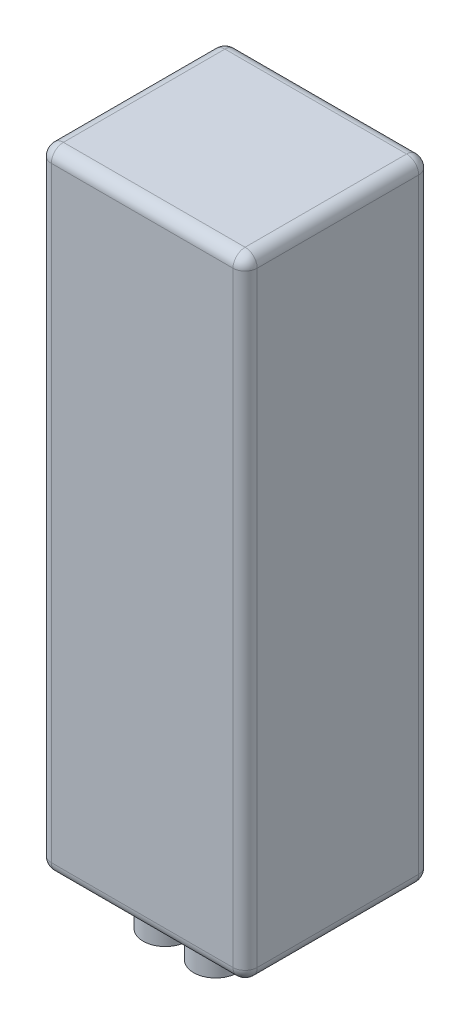
ISO-10303-21;
HEADER;
FILE_DESCRIPTION(('STEP AP214'),'2;1');
FILE_NAME('part.step','',(''),(''),'','','');
FILE_SCHEMA(('AUTOMOTIVE_DESIGN { 1 0 10303 214 1 1 1 1 }'));
ENDSEC;
DATA;
#1=APPLICATION_CONTEXT('core data for automotive mechanical design processes');
#2=APPLICATION_PROTOCOL_DEFINITION('international standard','automotive_design',2000,#1);
#3=PRODUCT_CONTEXT('',#1,'mechanical');
#4=PRODUCT('Part','Part','',(#3));
#5=PRODUCT_RELATED_PRODUCT_CATEGORY('part','',(#4));
#6=PRODUCT_DEFINITION_FORMATION('','',#4);
#7=PRODUCT_DEFINITION_CONTEXT('part definition',#1,'design');
#8=PRODUCT_DEFINITION('design','',#6,#7);
#9=PRODUCT_DEFINITION_SHAPE('','',#8);
#10=(LENGTH_UNIT() NAMED_UNIT(*) SI_UNIT(.MILLI.,.METRE.));
#11=(NAMED_UNIT(*) PLANE_ANGLE_UNIT() SI_UNIT($,.RADIAN.));
#12=(NAMED_UNIT(*) SI_UNIT($,.STERADIAN.) SOLID_ANGLE_UNIT());
#13=UNCERTAINTY_MEASURE_WITH_UNIT(LENGTH_MEASURE(1.E-05),#10,'distance_accuracy_value','');
#14=(GEOMETRIC_REPRESENTATION_CONTEXT(3) GLOBAL_UNCERTAINTY_ASSIGNED_CONTEXT((#13)) GLOBAL_UNIT_ASSIGNED_CONTEXT((#10,
#11,#12)) REPRESENTATION_CONTEXT('',''));
#15=CARTESIAN_POINT('',(0.,0.,0.));
#16=DIRECTION('',(0.,0.,1.));
#17=DIRECTION('',(1.,0.,0.));
#18=AXIS2_PLACEMENT_3D('',#15,#16,#17);
#19=CARTESIAN_POINT('',(-39.4955547458553,156.,-20.7));
#20=DIRECTION('',(1.,0.,0.));
#21=DIRECTION('',(0.,0.,-1.));
#22=AXIS2_PLACEMENT_3D('',#19,#20,#21);
#23=PLANE('',#22);
#24=DIRECTION('',(0.,0.,1.));
#25=VECTOR('',#24,1.);
#26=CARTESIAN_POINT('',(-39.4955547458553,153.,-20.7));
#27=LINE('',#26,#25);
#28=CARTESIAN_POINT('',(-39.4955547458553,153.,22.3));
#29=VERTEX_POINT('',#28);
#30=CARTESIAN_POINT('',(-39.4955547458553,153.,-17.7));
#31=VERTEX_POINT('',#30);
#32=EDGE_CURVE('E198',#29,#31,#27,.F.);
#33=ORIENTED_EDGE('',*,*,#32,.T.);
#34=DIRECTION('',(0.,-1.,0.));
#35=VECTOR('',#34,1.);
#36=CARTESIAN_POINT('',(-39.4955547458553,156.,-17.7));
#37=LINE('',#36,#35);
#38=CARTESIAN_POINT('',(-39.4955547458553,3.,-17.7));
#39=VERTEX_POINT('',#38);
#40=EDGE_CURVE('E201',#31,#39,#37,.T.);
#41=ORIENTED_EDGE('',*,*,#40,.T.);
#42=DIRECTION('',(0.,0.,1.));
#43=VECTOR('',#42,1.);
#44=CARTESIAN_POINT('',(-39.4955547458553,3.,-20.7));
#45=LINE('',#44,#43);
#46=CARTESIAN_POINT('',(-39.4955547458553,3.,22.3));
#47=VERTEX_POINT('',#46);
#48=EDGE_CURVE('E196',#39,#47,#45,.T.);
#49=ORIENTED_EDGE('',*,*,#48,.T.);
#50=DIRECTION('',(0.,-1.,0.));
#51=VECTOR('',#50,1.);
#52=CARTESIAN_POINT('',(-39.4955547458553,156.,22.3));
#53=LINE('',#52,#51);
#54=EDGE_CURVE('E194',#47,#29,#53,.F.);
#55=ORIENTED_EDGE('',*,*,#54,.T.);
#56=EDGE_LOOP('',(#33,#41,#49,#55));
#57=FACE_BOUND('',#56,.T.);
#58=ADVANCED_FACE('F42',(#57),#23,.F.);
#59=CARTESIAN_POINT('',(-39.4955547458553,156.,25.3));
#60=DIRECTION('',(0.,0.,-1.));
#61=DIRECTION('',(-1.,0.,0.));
#62=AXIS2_PLACEMENT_3D('',#59,#60,#61);
#63=PLANE('',#62);
#64=DIRECTION('',(1.,0.,0.));
#65=VECTOR('',#64,1.);
#66=CARTESIAN_POINT('',(-39.4955547458553,153.,25.3));
#67=LINE('',#66,#65);
#68=CARTESIAN_POINT('',(8.50444525414467,153.,25.3));
#69=VERTEX_POINT('',#68);
#70=CARTESIAN_POINT('',(-36.4955547458553,153.,25.3));
#71=VERTEX_POINT('',#70);
#72=EDGE_CURVE('E57',#69,#71,#67,.F.);
#73=ORIENTED_EDGE('',*,*,#72,.T.);
#74=DIRECTION('',(0.,-1.,0.));
#75=VECTOR('',#74,1.);
#76=CARTESIAN_POINT('',(-36.4955547458553,156.,25.3));
#77=LINE('',#76,#75);
#78=CARTESIAN_POINT('',(-36.4955547458553,3.,25.3));
#79=VERTEX_POINT('',#78);
#80=EDGE_CURVE('E216',#71,#79,#77,.T.);
#81=ORIENTED_EDGE('',*,*,#80,.T.);
#82=DIRECTION('',(1.,0.,0.));
#83=VECTOR('',#82,1.);
#84=CARTESIAN_POINT('',(-39.4955547458553,3.,25.3));
#85=LINE('',#84,#83);
#86=CARTESIAN_POINT('',(8.50444525414467,3.,25.3));
#87=VERTEX_POINT('',#86);
#88=EDGE_CURVE('E212',#79,#87,#85,.T.);
#89=ORIENTED_EDGE('',*,*,#88,.T.);
#90=DIRECTION('',(0.,-1.,0.));
#91=VECTOR('',#90,1.);
#92=CARTESIAN_POINT('',(8.50444525414467,156.,25.3));
#93=LINE('',#92,#91);
#94=EDGE_CURVE('E62',#87,#69,#93,.F.);
#95=ORIENTED_EDGE('',*,*,#94,.T.);
#96=EDGE_LOOP('',(#73,#81,#89,#95));
#97=FACE_BOUND('',#96,.T.);
#98=ADVANCED_FACE('F328',(#97),#63,.F.);
#99=CARTESIAN_POINT('',(11.5044452541447,156.,-20.7));
#100=DIRECTION('',(-1.,0.,0.));
#101=DIRECTION('',(0.,0.,1.));
#102=AXIS2_PLACEMENT_3D('',#99,#100,#101);
#103=PLANE('',#102);
#104=DIRECTION('',(0.,0.,-1.));
#105=VECTOR('',#104,1.);
#106=CARTESIAN_POINT('',(11.5044452541447,3.,-20.7));
#107=LINE('',#106,#105);
#108=CARTESIAN_POINT('',(11.5044452541447,3.,22.3));
#109=VERTEX_POINT('',#108);
#110=CARTESIAN_POINT('',(11.5044452541447,3.,-17.7));
#111=VERTEX_POINT('',#110);
#112=EDGE_CURVE('E141',#109,#111,#107,.T.);
#113=ORIENTED_EDGE('',*,*,#112,.T.);
#114=DIRECTION('',(0.,-1.,0.));
#115=VECTOR('',#114,1.);
#116=CARTESIAN_POINT('',(11.5044452541447,156.,-17.7));
#117=LINE('',#116,#115);
#118=CARTESIAN_POINT('',(11.5044452541447,153.,-17.7));
#119=VERTEX_POINT('',#118);
#120=EDGE_CURVE('E137',#111,#119,#117,.F.);
#121=ORIENTED_EDGE('',*,*,#120,.T.);
#122=DIRECTION('',(0.,0.,-1.));
#123=VECTOR('',#122,1.);
#124=CARTESIAN_POINT('',(11.5044452541447,153.,25.3));
#125=LINE('',#124,#123);
#126=CARTESIAN_POINT('',(11.5044452541447,153.,22.3));
#127=VERTEX_POINT('',#126);
#128=EDGE_CURVE('E129',#119,#127,#125,.F.);
#129=ORIENTED_EDGE('',*,*,#128,.T.);
#130=DIRECTION('',(0.,-1.,0.));
#131=VECTOR('',#130,1.);
#132=CARTESIAN_POINT('',(11.5044452541447,156.,22.3));
#133=LINE('',#132,#131);
#134=EDGE_CURVE('E134',#127,#109,#133,.T.);
#135=ORIENTED_EDGE('',*,*,#134,.T.);
#136=EDGE_LOOP('',(#113,#121,#129,#135));
#137=FACE_BOUND('',#136,.T.);
#138=ADVANCED_FACE('F132',(#137),#103,.F.);
#139=CARTESIAN_POINT('',(-39.4955547458553,156.,-20.7));
#140=DIRECTION('',(0.,0.,1.));
#141=DIRECTION('',(1.,0.,0.));
#142=AXIS2_PLACEMENT_3D('',#139,#140,#141);
#143=PLANE('',#142);
#144=DIRECTION('',(-1.,0.,0.));
#145=VECTOR('',#144,1.);
#146=CARTESIAN_POINT('',(11.5044452541447,153.,-20.7));
#147=LINE('',#146,#145);
#148=CARTESIAN_POINT('',(-36.4955547458553,153.,-20.7));
#149=VERTEX_POINT('',#148);
#150=CARTESIAN_POINT('',(8.50444525414466,153.,-20.7));
#151=VERTEX_POINT('',#150);
#152=EDGE_CURVE('E207',#149,#151,#147,.F.);
#153=ORIENTED_EDGE('',*,*,#152,.T.);
#154=DIRECTION('',(0.,-1.,0.));
#155=VECTOR('',#154,1.);
#156=CARTESIAN_POINT('',(8.50444525414466,156.,-20.7));
#157=LINE('',#156,#155);
#158=CARTESIAN_POINT('',(8.50444525414466,3.,-20.7));
#159=VERTEX_POINT('',#158);
#160=EDGE_CURVE('E209',#151,#159,#157,.T.);
#161=ORIENTED_EDGE('',*,*,#160,.T.);
#162=DIRECTION('',(-1.,0.,0.));
#163=VECTOR('',#162,1.);
#164=CARTESIAN_POINT('',(-39.4955547458553,3.,-20.7));
#165=LINE('',#164,#163);
#166=CARTESIAN_POINT('',(-36.4955547458553,3.,-20.7));
#167=VERTEX_POINT('',#166);
#168=EDGE_CURVE('E203',#159,#167,#165,.T.);
#169=ORIENTED_EDGE('',*,*,#168,.T.);
#170=DIRECTION('',(0.,-1.,0.));
#171=VECTOR('',#170,1.);
#172=CARTESIAN_POINT('',(-36.4955547458553,156.,-20.7));
#173=LINE('',#172,#171);
#174=EDGE_CURVE('E205',#167,#149,#173,.F.);
#175=ORIENTED_EDGE('',*,*,#174,.T.);
#176=EDGE_LOOP('',(#153,#161,#169,#175));
#177=FACE_BOUND('',#176,.T.);
#178=ADVANCED_FACE('F369',(#177),#143,.F.);
#179=CARTESIAN_POINT('',(0.,156.,0.));
#180=DIRECTION('',(0.,1.,0.));
#181=DIRECTION('',(0.,0.,1.));
#182=AXIS2_PLACEMENT_3D('',#179,#180,#181);
#183=PLANE('',#182);
#184=DIRECTION('',(0.,0.,-1.));
#185=VECTOR('',#184,1.);
#186=CARTESIAN_POINT('',(8.50444525414466,156.,-20.7));
#187=LINE('',#186,#185);
#188=CARTESIAN_POINT('',(8.50444525414467,156.,22.3));
#189=VERTEX_POINT('',#188);
#190=CARTESIAN_POINT('',(8.50444525414466,156.,-17.7));
#191=VERTEX_POINT('',#190);
#192=EDGE_CURVE('E149',#189,#191,#187,.T.);
#193=ORIENTED_EDGE('',*,*,#192,.T.);
#194=DIRECTION('',(-1.,0.,0.));
#195=VECTOR('',#194,1.);
#196=CARTESIAN_POINT('',(-39.4955547458553,156.,-17.7));
#197=LINE('',#196,#195);
#198=CARTESIAN_POINT('',(-36.4955547458553,156.,-17.7));
#199=VERTEX_POINT('',#198);
#200=EDGE_CURVE('E192',#191,#199,#197,.T.);
#201=ORIENTED_EDGE('',*,*,#200,.T.);
#202=DIRECTION('',(0.,0.,1.));
#203=VECTOR('',#202,1.);
#204=CARTESIAN_POINT('',(-36.4955547458553,156.,25.3));
#205=LINE('',#204,#203);
#206=CARTESIAN_POINT('',(-36.4955547458553,156.,22.3));
#207=VERTEX_POINT('',#206);
#208=EDGE_CURVE('E189',#199,#207,#205,.T.);
#209=ORIENTED_EDGE('',*,*,#208,.T.);
#210=DIRECTION('',(1.,0.,0.));
#211=VECTOR('',#210,1.);
#212=CARTESIAN_POINT('',(11.5044452541447,156.,22.3));
#213=LINE('',#212,#211);
#214=EDGE_CURVE('E187',#207,#189,#213,.T.);
#215=ORIENTED_EDGE('',*,*,#214,.T.);
#216=EDGE_LOOP('',(#193,#201,#209,#215));
#217=FACE_BOUND('',#216,.T.);
#218=ADVANCED_FACE('F274',(#217),#183,.T.);
#219=CARTESIAN_POINT('',(0.,0.,0.));
#220=DIRECTION('',(0.,1.,0.));
#221=DIRECTION('',(0.,0.,1.));
#222=AXIS2_PLACEMENT_3D('',#219,#220,#221);
#223=PLANE('',#222);
#224=CARTESIAN_POINT('',(-8.24897588452238,0.,12.8249841101593));
#225=DIRECTION('',(0.,1.,0.));
#226=DIRECTION('',(0.,0.,1.));
#227=AXIS2_PLACEMENT_3D('',#224,#225,#226);
#228=CIRCLE('',#227,5.4796658138375);
#229=CARTESIAN_POINT('',(-8.24897588452238,0.,18.3046499239968));
#230=VERTEX_POINT('',#229);
#231=EDGE_CURVE('E11',#230,#230,#228,.F.);
#232=ORIENTED_EDGE('',*,*,#231,.F.);
#233=EDGE_LOOP('',(#232));
#234=FACE_BOUND('',#233,.T.);
#235=CARTESIAN_POINT('',(-21.2412411362317,0.,12.3252816004782));
#236=DIRECTION('',(0.,1.,0.));
#237=DIRECTION('',(0.,0.,1.));
#238=AXIS2_PLACEMENT_3D('',#235,#236,#237);
#239=CIRCLE('',#238,5.4796658138375);
#240=CARTESIAN_POINT('',(-21.2412411362317,0.,17.8049474143157));
#241=VERTEX_POINT('',#240);
#242=EDGE_CURVE('E50',#241,#241,#239,.F.);
#243=ORIENTED_EDGE('',*,*,#242,.F.);
#244=EDGE_LOOP('',(#243));
#245=FACE_BOUND('',#244,.T.);
#246=DIRECTION('',(0.,0.,1.));
#247=VECTOR('',#246,1.);
#248=CARTESIAN_POINT('',(-36.4955547458553,0.,0.));
#249=LINE('',#248,#247);
#250=CARTESIAN_POINT('',(-36.4955547458553,0.,22.3));
#251=VERTEX_POINT('',#250);
#252=CARTESIAN_POINT('',(-36.4955547458553,0.,-17.7));
#253=VERTEX_POINT('',#252);
#254=EDGE_CURVE('E180',#251,#253,#249,.F.);
#255=ORIENTED_EDGE('',*,*,#254,.T.);
#256=DIRECTION('',(-1.,0.,0.));
#257=VECTOR('',#256,1.);
#258=CARTESIAN_POINT('',(0.,0.,-17.7));
#259=LINE('',#258,#257);
#260=CARTESIAN_POINT('',(8.50444525414466,0.,-17.7));
#261=VERTEX_POINT('',#260);
#262=EDGE_CURVE('E185',#253,#261,#259,.F.);
#263=ORIENTED_EDGE('',*,*,#262,.T.);
#264=DIRECTION('',(0.,0.,-1.));
#265=VECTOR('',#264,1.);
#266=CARTESIAN_POINT('',(8.50444525414467,0.,0.));
#267=LINE('',#266,#265);
#268=CARTESIAN_POINT('',(8.50444525414467,0.,22.3));
#269=VERTEX_POINT('',#268);
#270=EDGE_CURVE('E182',#261,#269,#267,.F.);
#271=ORIENTED_EDGE('',*,*,#270,.T.);
#272=DIRECTION('',(1.,0.,0.));
#273=VECTOR('',#272,1.);
#274=CARTESIAN_POINT('',(0.,0.,22.3));
#275=LINE('',#274,#273);
#276=EDGE_CURVE('E178',#269,#251,#275,.F.);
#277=ORIENTED_EDGE('',*,*,#276,.T.);
#278=EDGE_LOOP('',(#255,#263,#271,#277));
#279=FACE_BOUND('',#278,.T.);
#280=ADVANCED_FACE('F271',(#234,#245,#279),#223,.F.);
#281=CARTESIAN_POINT('',(-36.4955547458553,153.,0.));
#282=DIRECTION('',(0.,0.,-1.));
#283=DIRECTION('',(-1.,0.,0.));
#284=AXIS2_PLACEMENT_3D('',#281,#282,#283);
#285=CYLINDRICAL_SURFACE('',#284,3.);
#286=CARTESIAN_POINT('',(-36.4955547458553,153.,22.3));
#287=DIRECTION('',(0.,0.,1.));
#288=DIRECTION('',(1.,0.,0.));
#289=AXIS2_PLACEMENT_3D('',#286,#287,#288);
#290=CIRCLE('',#289,3.);
#291=EDGE_CURVE('E167',#207,#29,#290,.T.);
#292=ORIENTED_EDGE('',*,*,#291,.F.);
#293=ORIENTED_EDGE('',*,*,#208,.F.);
#294=CARTESIAN_POINT('',(-36.4955547458553,153.,-17.7));
#295=DIRECTION('',(0.,0.,-1.));
#296=DIRECTION('',(-1.,0.,0.));
#297=AXIS2_PLACEMENT_3D('',#294,#295,#296);
#298=CIRCLE('',#297,3.);
#299=EDGE_CURVE('E170',#31,#199,#298,.T.);
#300=ORIENTED_EDGE('',*,*,#299,.F.);
#301=ORIENTED_EDGE('',*,*,#32,.F.);
#302=EDGE_LOOP('',(#292,#293,#300,#301));
#303=FACE_BOUND('',#302,.T.);
#304=ADVANCED_FACE('F44',(#303),#285,.T.);
#305=CARTESIAN_POINT('',(-36.4955547458553,153.,22.3));
#306=DIRECTION('',(-1.,0.,0.));
#307=DIRECTION('',(0.,0.,1.));
#308=AXIS2_PLACEMENT_3D('',#305,#306,#307);
#309=SPHERICAL_SURFACE('',#308,3.);
#310=CARTESIAN_POINT('',(-36.4955547458553,153.,22.3));
#311=DIRECTION('',(-1.,0.,0.));
#312=DIRECTION('',(0.,0.,1.));
#313=AXIS2_PLACEMENT_3D('',#310,#311,#312);
#314=CIRCLE('',#313,3.);
#315=EDGE_CURVE('E260',#207,#71,#314,.F.);
#316=ORIENTED_EDGE('',*,*,#315,.F.);
#317=ORIENTED_EDGE('',*,*,#291,.T.);
#318=CARTESIAN_POINT('',(-36.4955547458553,153.,22.3));
#319=DIRECTION('',(0.,1.,0.));
#320=DIRECTION('',(0.,0.,1.));
#321=AXIS2_PLACEMENT_3D('',#318,#319,#320);
#322=CIRCLE('',#321,3.);
#323=EDGE_CURVE('E262',#71,#29,#322,.F.);
#324=ORIENTED_EDGE('',*,*,#323,.F.);
#325=EDGE_LOOP('',(#316,#317,#324));
#326=FACE_BOUND('',#325,.T.);
#327=ADVANCED_FACE('F323',(#326),#309,.T.);
#328=CARTESIAN_POINT('',(-36.4955547458553,153.,-17.7));
#329=DIRECTION('',(0.,1.,0.));
#330=DIRECTION('',(0.,0.,1.));
#331=AXIS2_PLACEMENT_3D('',#328,#329,#330);
#332=SPHERICAL_SURFACE('',#331,3.);
#333=CARTESIAN_POINT('',(-36.4955547458553,153.,-17.7));
#334=DIRECTION('',(0.,1.,0.));
#335=DIRECTION('',(0.,0.,1.));
#336=AXIS2_PLACEMENT_3D('',#333,#334,#335);
#337=CIRCLE('',#336,3.);
#338=EDGE_CURVE('E254',#31,#149,#337,.F.);
#339=ORIENTED_EDGE('',*,*,#338,.F.);
#340=ORIENTED_EDGE('',*,*,#299,.T.);
#341=CARTESIAN_POINT('',(-36.4955547458553,153.,-17.7));
#342=DIRECTION('',(-1.,0.,0.));
#343=DIRECTION('',(0.,0.,1.));
#344=AXIS2_PLACEMENT_3D('',#341,#342,#343);
#345=CIRCLE('',#344,3.);
#346=EDGE_CURVE('E257',#149,#199,#345,.F.);
#347=ORIENTED_EDGE('',*,*,#346,.F.);
#348=EDGE_LOOP('',(#339,#340,#347));
#349=FACE_BOUND('',#348,.T.);
#350=ADVANCED_FACE('F403',(#349),#332,.T.);
#351=CARTESIAN_POINT('',(-36.4955547458553,156.,22.3));
#352=DIRECTION('',(0.,-1.,0.));
#353=DIRECTION('',(0.,0.,-1.));
#354=AXIS2_PLACEMENT_3D('',#351,#352,#353);
#355=CYLINDRICAL_SURFACE('',#354,3.);
#356=ORIENTED_EDGE('',*,*,#323,.T.);
#357=ORIENTED_EDGE('',*,*,#54,.F.);
#358=CARTESIAN_POINT('',(-36.4955547458553,3.,22.3));
#359=DIRECTION('',(0.,-1.,0.));
#360=DIRECTION('',(0.,0.,-1.));
#361=AXIS2_PLACEMENT_3D('',#358,#359,#360);
#362=CIRCLE('',#361,3.);
#363=EDGE_CURVE('E248',#79,#47,#362,.T.);
#364=ORIENTED_EDGE('',*,*,#363,.F.);
#365=ORIENTED_EDGE('',*,*,#80,.F.);
#366=EDGE_LOOP('',(#356,#357,#364,#365));
#367=FACE_BOUND('',#366,.T.);
#368=ADVANCED_FACE('F327',(#367),#355,.T.);
#369=CARTESIAN_POINT('',(0.,153.,22.3));
#370=DIRECTION('',(-1.,0.,0.));
#371=DIRECTION('',(0.,0.,1.));
#372=AXIS2_PLACEMENT_3D('',#369,#370,#371);
#373=CYLINDRICAL_SURFACE('',#372,3.);
#374=ORIENTED_EDGE('',*,*,#315,.T.);
#375=ORIENTED_EDGE('',*,*,#72,.F.);
#376=CARTESIAN_POINT('',(8.50444525414467,153.,22.3));
#377=DIRECTION('',(1.,0.,0.));
#378=DIRECTION('',(0.,0.,-1.));
#379=AXIS2_PLACEMENT_3D('',#376,#377,#378);
#380=CIRCLE('',#379,3.);
#381=EDGE_CURVE('E153',#189,#69,#380,.T.);
#382=ORIENTED_EDGE('',*,*,#381,.F.);
#383=ORIENTED_EDGE('',*,*,#214,.F.);
#384=EDGE_LOOP('',(#374,#375,#382,#383));
#385=FACE_BOUND('',#384,.T.);
#386=ADVANCED_FACE('F318',(#385),#373,.T.);
#387=CARTESIAN_POINT('',(8.50444525414467,153.,0.));
#388=DIRECTION('',(0.,0.,1.));
#389=DIRECTION('',(1.,0.,0.));
#390=AXIS2_PLACEMENT_3D('',#387,#388,#389);
#391=CYLINDRICAL_SURFACE('',#390,3.);
#392=CARTESIAN_POINT('',(8.50444525414466,153.,-17.7));
#393=DIRECTION('',(0.,0.,-1.));
#394=DIRECTION('',(-1.,0.,0.));
#395=AXIS2_PLACEMENT_3D('',#392,#393,#394);
#396=CIRCLE('',#395,3.);
#397=EDGE_CURVE('E154',#191,#119,#396,.T.);
#398=ORIENTED_EDGE('',*,*,#397,.F.);
#399=ORIENTED_EDGE('',*,*,#192,.F.);
#400=CARTESIAN_POINT('',(8.50444525414467,153.,22.3));
#401=DIRECTION('',(0.,0.,1.));
#402=DIRECTION('',(0.,-1.,0.));
#403=AXIS2_PLACEMENT_3D('',#400,#401,#402);
#404=CIRCLE('',#403,3.);
#405=EDGE_CURVE('E145',#127,#189,#404,.T.);
#406=ORIENTED_EDGE('',*,*,#405,.F.);
#407=ORIENTED_EDGE('',*,*,#128,.F.);
#408=EDGE_LOOP('',(#398,#399,#406,#407));
#409=FACE_BOUND('',#408,.T.);
#410=ADVANCED_FACE('F147',(#409),#391,.T.);
#411=CARTESIAN_POINT('',(0.,153.,-17.7));
#412=DIRECTION('',(1.,0.,0.));
#413=DIRECTION('',(0.,0.,-1.));
#414=AXIS2_PLACEMENT_3D('',#411,#412,#413);
#415=CYLINDRICAL_SURFACE('',#414,3.);
#416=ORIENTED_EDGE('',*,*,#346,.T.);
#417=ORIENTED_EDGE('',*,*,#200,.F.);
#418=CARTESIAN_POINT('',(8.50444525414466,153.,-17.7));
#419=DIRECTION('',(1.,0.,0.));
#420=DIRECTION('',(0.,1.,0.));
#421=AXIS2_PLACEMENT_3D('',#418,#419,#420);
#422=CIRCLE('',#421,3.);
#423=EDGE_CURVE('E244',#151,#191,#422,.T.);
#424=ORIENTED_EDGE('',*,*,#423,.F.);
#425=ORIENTED_EDGE('',*,*,#152,.F.);
#426=EDGE_LOOP('',(#416,#417,#424,#425));
#427=FACE_BOUND('',#426,.T.);
#428=ADVANCED_FACE('F310',(#427),#415,.T.);
#429=CARTESIAN_POINT('',(-36.4955547458553,156.,-17.7));
#430=DIRECTION('',(0.,-1.,0.));
#431=DIRECTION('',(0.,0.,-1.));
#432=AXIS2_PLACEMENT_3D('',#429,#430,#431);
#433=CYLINDRICAL_SURFACE('',#432,3.);
#434=ORIENTED_EDGE('',*,*,#338,.T.);
#435=ORIENTED_EDGE('',*,*,#174,.F.);
#436=CARTESIAN_POINT('',(-36.4955547458553,3.,-17.7));
#437=DIRECTION('',(0.,-1.,0.));
#438=DIRECTION('',(0.,0.,-1.));
#439=AXIS2_PLACEMENT_3D('',#436,#437,#438);
#440=CIRCLE('',#439,3.);
#441=EDGE_CURVE('E241',#39,#167,#440,.T.);
#442=ORIENTED_EDGE('',*,*,#441,.F.);
#443=ORIENTED_EDGE('',*,*,#40,.F.);
#444=EDGE_LOOP('',(#434,#435,#442,#443));
#445=FACE_BOUND('',#444,.T.);
#446=ADVANCED_FACE('F439',(#445),#433,.T.);
#447=CARTESIAN_POINT('',(-36.4955547458553,3.,-20.7));
#448=DIRECTION('',(0.,0.,1.));
#449=DIRECTION('',(1.,0.,0.));
#450=AXIS2_PLACEMENT_3D('',#447,#448,#449);
#451=CYLINDRICAL_SURFACE('',#450,3.);
#452=CARTESIAN_POINT('',(-36.4955547458553,3.,22.3));
#453=DIRECTION('',(0.,0.,1.));
#454=DIRECTION('',(1.,0.,0.));
#455=AXIS2_PLACEMENT_3D('',#452,#453,#454);
#456=CIRCLE('',#455,3.);
#457=EDGE_CURVE('E251',#47,#251,#456,.T.);
#458=ORIENTED_EDGE('',*,*,#457,.F.);
#459=ORIENTED_EDGE('',*,*,#48,.F.);
#460=CARTESIAN_POINT('',(-36.4955547458553,3.,-17.7));
#461=DIRECTION('',(0.,0.,-1.));
#462=DIRECTION('',(-1.,0.,0.));
#463=AXIS2_PLACEMENT_3D('',#460,#461,#462);
#464=CIRCLE('',#463,3.);
#465=EDGE_CURVE('E238',#253,#39,#464,.T.);
#466=ORIENTED_EDGE('',*,*,#465,.F.);
#467=ORIENTED_EDGE('',*,*,#254,.F.);
#468=EDGE_LOOP('',(#458,#459,#466,#467));
#469=FACE_BOUND('',#468,.T.);
#470=ADVANCED_FACE('F286',(#469),#451,.T.);
#471=CARTESIAN_POINT('',(-36.4955547458553,3.,22.3));
#472=DIRECTION('',(-1.,0.,0.));
#473=DIRECTION('',(0.,-1.,0.));
#474=AXIS2_PLACEMENT_3D('',#471,#472,#473);
#475=SPHERICAL_SURFACE('',#474,3.);
#476=ORIENTED_EDGE('',*,*,#363,.T.);
#477=ORIENTED_EDGE('',*,*,#457,.T.);
#478=CARTESIAN_POINT('',(-36.4955547458553,3.,22.3));
#479=DIRECTION('',(-1.,0.,0.));
#480=DIRECTION('',(0.,0.,1.));
#481=AXIS2_PLACEMENT_3D('',#478,#479,#480);
#482=CIRCLE('',#481,3.);
#483=EDGE_CURVE('E160',#79,#251,#482,.F.);
#484=ORIENTED_EDGE('',*,*,#483,.F.);
#485=EDGE_LOOP('',(#476,#477,#484));
#486=FACE_BOUND('',#485,.T.);
#487=ADVANCED_FACE('F455',(#486),#475,.T.);
#488=CARTESIAN_POINT('',(8.50444525414467,153.,22.3));
#489=DIRECTION('',(0.,1.,0.));
#490=DIRECTION('',(0.,0.,1.));
#491=AXIS2_PLACEMENT_3D('',#488,#489,#490);
#492=SPHERICAL_SURFACE('',#491,3.);
#493=ORIENTED_EDGE('',*,*,#405,.T.);
#494=ORIENTED_EDGE('',*,*,#381,.T.);
#495=CARTESIAN_POINT('',(8.50444525414467,153.,22.3));
#496=DIRECTION('',(0.,1.,0.));
#497=DIRECTION('',(0.,0.,1.));
#498=AXIS2_PLACEMENT_3D('',#495,#496,#497);
#499=CIRCLE('',#498,3.);
#500=EDGE_CURVE('E157',#127,#69,#499,.F.);
#501=ORIENTED_EDGE('',*,*,#500,.F.);
#502=EDGE_LOOP('',(#493,#494,#501));
#503=FACE_BOUND('',#502,.T.);
#504=ADVANCED_FACE('F158',(#503),#492,.T.);
#505=CARTESIAN_POINT('',(8.50444525414466,153.,-17.7));
#506=DIRECTION('',(0.,1.,0.));
#507=DIRECTION('',(0.,0.,1.));
#508=AXIS2_PLACEMENT_3D('',#505,#506,#507);
#509=SPHERICAL_SURFACE('',#508,3.);
#510=ORIENTED_EDGE('',*,*,#423,.T.);
#511=ORIENTED_EDGE('',*,*,#397,.T.);
#512=CARTESIAN_POINT('',(8.50444525414466,153.,-17.7));
#513=DIRECTION('',(0.,1.,0.));
#514=DIRECTION('',(0.,0.,1.));
#515=AXIS2_PLACEMENT_3D('',#512,#513,#514);
#516=CIRCLE('',#515,3.);
#517=EDGE_CURVE('E161',#151,#119,#516,.F.);
#518=ORIENTED_EDGE('',*,*,#517,.F.);
#519=EDGE_LOOP('',(#510,#511,#518));
#520=FACE_BOUND('',#519,.T.);
#521=ADVANCED_FACE('F306',(#520),#509,.T.);
#522=CARTESIAN_POINT('',(-36.4955547458553,3.,-17.7));
#523=DIRECTION('',(-1.,0.,0.));
#524=DIRECTION('',(0.,-1.,0.));
#525=AXIS2_PLACEMENT_3D('',#522,#523,#524);
#526=SPHERICAL_SURFACE('',#525,3.);
#527=ORIENTED_EDGE('',*,*,#465,.T.);
#528=ORIENTED_EDGE('',*,*,#441,.T.);
#529=CARTESIAN_POINT('',(-36.4955547458553,3.,-17.7));
#530=DIRECTION('',(-1.,0.,0.));
#531=DIRECTION('',(0.,0.,1.));
#532=AXIS2_PLACEMENT_3D('',#529,#530,#531);
#533=CIRCLE('',#532,3.);
#534=EDGE_CURVE('E231',#253,#167,#533,.F.);
#535=ORIENTED_EDGE('',*,*,#534,.F.);
#536=EDGE_LOOP('',(#527,#528,#535));
#537=FACE_BOUND('',#536,.T.);
#538=ADVANCED_FACE('F289',(#537),#526,.T.);
#539=CARTESIAN_POINT('',(-39.4955547458553,3.,22.3));
#540=DIRECTION('',(1.,0.,0.));
#541=DIRECTION('',(0.,0.,-1.));
#542=AXIS2_PLACEMENT_3D('',#539,#540,#541);
#543=CYLINDRICAL_SURFACE('',#542,3.);
#544=ORIENTED_EDGE('',*,*,#483,.T.);
#545=ORIENTED_EDGE('',*,*,#276,.F.);
#546=CARTESIAN_POINT('',(8.50444525414467,3.,22.3));
#547=DIRECTION('',(1.,0.,0.));
#548=DIRECTION('',(0.,0.,-1.));
#549=AXIS2_PLACEMENT_3D('',#546,#547,#548);
#550=CIRCLE('',#549,3.);
#551=EDGE_CURVE('E228',#87,#269,#550,.T.);
#552=ORIENTED_EDGE('',*,*,#551,.F.);
#553=ORIENTED_EDGE('',*,*,#88,.F.);
#554=EDGE_LOOP('',(#544,#545,#552,#553));
#555=FACE_BOUND('',#554,.T.);
#556=ADVANCED_FACE('F332',(#555),#543,.T.);
#557=CARTESIAN_POINT('',(8.50444525414467,156.,22.3));
#558=DIRECTION('',(0.,-1.,0.));
#559=DIRECTION('',(0.,0.,-1.));
#560=AXIS2_PLACEMENT_3D('',#557,#558,#559);
#561=CYLINDRICAL_SURFACE('',#560,3.);
#562=ORIENTED_EDGE('',*,*,#500,.T.);
#563=ORIENTED_EDGE('',*,*,#94,.F.);
#564=CARTESIAN_POINT('',(8.50444525414467,3.,22.3));
#565=DIRECTION('',(0.,-1.,0.));
#566=DIRECTION('',(0.,0.,-1.));
#567=AXIS2_PLACEMENT_3D('',#564,#565,#566);
#568=CIRCLE('',#567,3.);
#569=EDGE_CURVE('E165',#109,#87,#568,.T.);
#570=ORIENTED_EDGE('',*,*,#569,.F.);
#571=ORIENTED_EDGE('',*,*,#134,.F.);
#572=EDGE_LOOP('',(#562,#563,#570,#571));
#573=FACE_BOUND('',#572,.T.);
#574=ADVANCED_FACE('F163',(#573),#561,.T.);
#575=CARTESIAN_POINT('',(8.50444525414466,156.,-17.7));
#576=DIRECTION('',(0.,-1.,0.));
#577=DIRECTION('',(0.,0.,-1.));
#578=AXIS2_PLACEMENT_3D('',#575,#576,#577);
#579=CYLINDRICAL_SURFACE('',#578,3.);
#580=ORIENTED_EDGE('',*,*,#517,.T.);
#581=ORIENTED_EDGE('',*,*,#120,.F.);
#582=CARTESIAN_POINT('',(8.50444525414466,3.,-17.7));
#583=DIRECTION('',(0.,-1.,0.));
#584=DIRECTION('',(0.,0.,-1.));
#585=AXIS2_PLACEMENT_3D('',#582,#583,#584);
#586=CIRCLE('',#585,3.);
#587=EDGE_CURVE('E224',#159,#111,#586,.T.);
#588=ORIENTED_EDGE('',*,*,#587,.F.);
#589=ORIENTED_EDGE('',*,*,#160,.F.);
#590=EDGE_LOOP('',(#580,#581,#588,#589));
#591=FACE_BOUND('',#590,.T.);
#592=ADVANCED_FACE('F303',(#591),#579,.T.);
#593=CARTESIAN_POINT('',(-39.4955547458553,3.,-17.7));
#594=DIRECTION('',(-1.,0.,0.));
#595=DIRECTION('',(0.,0.,1.));
#596=AXIS2_PLACEMENT_3D('',#593,#594,#595);
#597=CYLINDRICAL_SURFACE('',#596,3.);
#598=ORIENTED_EDGE('',*,*,#534,.T.);
#599=ORIENTED_EDGE('',*,*,#168,.F.);
#600=CARTESIAN_POINT('',(8.50444525414466,3.,-17.7));
#601=DIRECTION('',(1.,0.,0.));
#602=DIRECTION('',(0.,0.,-1.));
#603=AXIS2_PLACEMENT_3D('',#600,#601,#602);
#604=CIRCLE('',#603,3.);
#605=EDGE_CURVE('E222',#261,#159,#604,.T.);
#606=ORIENTED_EDGE('',*,*,#605,.F.);
#607=ORIENTED_EDGE('',*,*,#262,.F.);
#608=EDGE_LOOP('',(#598,#599,#606,#607));
#609=FACE_BOUND('',#608,.T.);
#610=ADVANCED_FACE('F292',(#609),#597,.T.);
#611=CARTESIAN_POINT('',(8.50444525414467,3.,22.3));
#612=DIRECTION('',(0.,0.,1.));
#613=DIRECTION('',(0.,-1.,0.));
#614=AXIS2_PLACEMENT_3D('',#611,#612,#613);
#615=SPHERICAL_SURFACE('',#614,3.);
#616=ORIENTED_EDGE('',*,*,#569,.T.);
#617=ORIENTED_EDGE('',*,*,#551,.T.);
#618=CARTESIAN_POINT('',(8.50444525414467,3.,22.3));
#619=DIRECTION('',(0.,0.,1.));
#620=DIRECTION('',(1.,0.,0.));
#621=AXIS2_PLACEMENT_3D('',#618,#619,#620);
#622=CIRCLE('',#621,3.);
#623=EDGE_CURVE('E220',#109,#269,#622,.F.);
#624=ORIENTED_EDGE('',*,*,#623,.F.);
#625=EDGE_LOOP('',(#616,#617,#624));
#626=FACE_BOUND('',#625,.T.);
#627=ADVANCED_FACE('F334',(#626),#615,.T.);
#628=CARTESIAN_POINT('',(8.50444525414466,3.,-17.7));
#629=DIRECTION('',(0.,0.,-1.));
#630=DIRECTION('',(0.,1.,0.));
#631=AXIS2_PLACEMENT_3D('',#628,#629,#630);
#632=SPHERICAL_SURFACE('',#631,3.);
#633=ORIENTED_EDGE('',*,*,#605,.T.);
#634=ORIENTED_EDGE('',*,*,#587,.T.);
#635=CARTESIAN_POINT('',(8.50444525414466,3.,-17.7));
#636=DIRECTION('',(0.,0.,-1.));
#637=DIRECTION('',(-1.,0.,0.));
#638=AXIS2_PLACEMENT_3D('',#635,#636,#637);
#639=CIRCLE('',#638,3.);
#640=EDGE_CURVE('E218',#261,#111,#639,.F.);
#641=ORIENTED_EDGE('',*,*,#640,.F.);
#642=EDGE_LOOP('',(#633,#634,#641));
#643=FACE_BOUND('',#642,.T.);
#644=ADVANCED_FACE('F300',(#643),#632,.T.);
#645=CARTESIAN_POINT('',(8.50444525414466,3.,-20.7));
#646=DIRECTION('',(0.,0.,-1.));
#647=DIRECTION('',(-1.,0.,0.));
#648=AXIS2_PLACEMENT_3D('',#645,#646,#647);
#649=CYLINDRICAL_SURFACE('',#648,3.);
#650=ORIENTED_EDGE('',*,*,#623,.T.);
#651=ORIENTED_EDGE('',*,*,#270,.F.);
#652=ORIENTED_EDGE('',*,*,#640,.T.);
#653=ORIENTED_EDGE('',*,*,#112,.F.);
#654=EDGE_LOOP('',(#650,#651,#652,#653));
#655=FACE_BOUND('',#654,.T.);
#656=ADVANCED_FACE('F298',(#655),#649,.T.);
#657=CARTESIAN_POINT('',(-21.2412411362317,-10.,12.3252816004782));
#658=DIRECTION('',(0.,1.,0.));
#659=DIRECTION('',(0.,0.,1.));
#660=AXIS2_PLACEMENT_3D('',#657,#658,#659);
#661=CYLINDRICAL_SURFACE('',#660,5.4796658138375);
#662=CARTESIAN_POINT('',(-21.2412411362317,-10.,12.3252816004782));
#663=DIRECTION('',(0.,-1.,0.));
#664=DIRECTION('',(0.,0.,-1.));
#665=AXIS2_PLACEMENT_3D('',#662,#663,#664);
#666=CIRCLE('',#665,5.4796658138375);
#667=CARTESIAN_POINT('',(-21.2412411362317,-10.,6.84561578664066));
#668=VERTEX_POINT('',#667);
#669=EDGE_CURVE('E173',#668,#668,#666,.T.);
#670=ORIENTED_EDGE('',*,*,#669,.F.);
#671=EDGE_LOOP('',(#670));
#672=FACE_BOUND('',#671,.T.);
#673=ORIENTED_EDGE('',*,*,#242,.T.);
#674=EDGE_LOOP('',(#673));
#675=FACE_BOUND('',#674,.T.);
#676=ADVANCED_FACE('F269',(#672,#675),#661,.T.);
#677=CARTESIAN_POINT('',(-21.2412411362317,-10.,12.3252816004782));
#678=DIRECTION('',(0.,-1.,0.));
#679=DIRECTION('',(0.,0.,-1.));
#680=AXIS2_PLACEMENT_3D('',#677,#678,#679);
#681=PLANE('',#680);
#682=ORIENTED_EDGE('',*,*,#669,.T.);
#683=EDGE_LOOP('',(#682));
#684=FACE_BOUND('',#683,.T.);
#685=ADVANCED_FACE('F356',(#684),#681,.T.);
#686=CARTESIAN_POINT('',(-8.24897588452238,-10.,12.8249841101593));
#687=DIRECTION('',(0.,1.,0.));
#688=DIRECTION('',(0.,0.,1.));
#689=AXIS2_PLACEMENT_3D('',#686,#687,#688);
#690=CYLINDRICAL_SURFACE('',#689,5.4796658138375);
#691=CARTESIAN_POINT('',(-8.24897588452238,-10.,12.8249841101593));
#692=DIRECTION('',(0.,-1.,0.));
#693=DIRECTION('',(0.,0.,-1.));
#694=AXIS2_PLACEMENT_3D('',#691,#692,#693);
#695=CIRCLE('',#694,5.4796658138375);
#696=CARTESIAN_POINT('',(-8.24897588452238,-10.,7.34531829632178));
#697=VERTEX_POINT('',#696);
#698=EDGE_CURVE('E559',#697,#697,#695,.T.);
#699=ORIENTED_EDGE('',*,*,#698,.F.);
#700=EDGE_LOOP('',(#699));
#701=FACE_BOUND('',#700,.T.);
#702=ORIENTED_EDGE('',*,*,#231,.T.);
#703=EDGE_LOOP('',(#702));
#704=FACE_BOUND('',#703,.T.);
#705=ADVANCED_FACE('F362',(#701,#704),#690,.T.);
#706=CARTESIAN_POINT('',(-8.24897588452238,-10.,12.8249841101593));
#707=DIRECTION('',(0.,-1.,0.));
#708=DIRECTION('',(0.,0.,-1.));
#709=AXIS2_PLACEMENT_3D('',#706,#707,#708);
#710=PLANE('',#709);
#711=ORIENTED_EDGE('',*,*,#698,.T.);
#712=EDGE_LOOP('',(#711));
#713=FACE_BOUND('',#712,.T.);
#714=ADVANCED_FACE('F545',(#713),#710,.T.);
#715=CLOSED_SHELL('',(#58,#98,#138,#178,#218,#280,#304,#327,#350,#368,#386,#410,#428,#446,#470,
#487,#504,#521,#538,#556,#574,#592,#610,#627,#644,#656,#676,#685,#705,#714));
#716=MANIFOLD_SOLID_BREP('B2',#715);
#717=ADVANCED_BREP_SHAPE_REPRESENTATION('',(#18,#716),#14);
#718=SHAPE_DEFINITION_REPRESENTATION(#9,#717);
ENDSEC;
END-ISO-10303-21;
